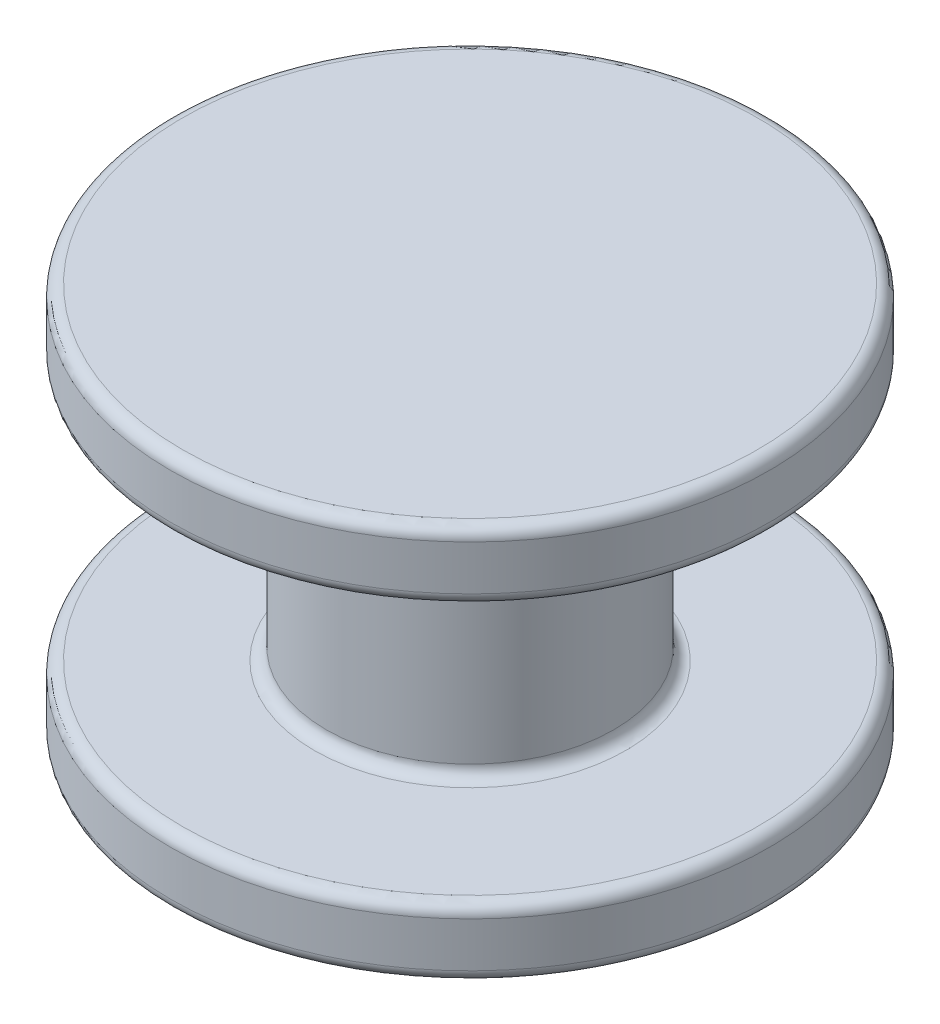
ISO-10303-21;
HEADER;
FILE_DESCRIPTION(('STEP AP214'),'2;1');
FILE_NAME('part.step','',(''),(''),'','','');
FILE_SCHEMA(('AUTOMOTIVE_DESIGN { 1 0 10303 214 1 1 1 1 }'));
ENDSEC;
DATA;
#1=APPLICATION_CONTEXT('core data for automotive mechanical design processes');
#2=APPLICATION_PROTOCOL_DEFINITION('international standard','automotive_design',2000,#1);
#3=PRODUCT_CONTEXT('',#1,'mechanical');
#4=PRODUCT('Part','Part','',(#3));
#5=PRODUCT_RELATED_PRODUCT_CATEGORY('part','',(#4));
#6=PRODUCT_DEFINITION_FORMATION('','',#4);
#7=PRODUCT_DEFINITION_CONTEXT('part definition',#1,'design');
#8=PRODUCT_DEFINITION('design','',#6,#7);
#9=PRODUCT_DEFINITION_SHAPE('','',#8);
#10=(LENGTH_UNIT() NAMED_UNIT(*) SI_UNIT(.MILLI.,.METRE.));
#11=(NAMED_UNIT(*) PLANE_ANGLE_UNIT() SI_UNIT($,.RADIAN.));
#12=(NAMED_UNIT(*) SI_UNIT($,.STERADIAN.) SOLID_ANGLE_UNIT());
#13=UNCERTAINTY_MEASURE_WITH_UNIT(LENGTH_MEASURE(1.E-05),#10,'distance_accuracy_value','');
#14=(GEOMETRIC_REPRESENTATION_CONTEXT(3) GLOBAL_UNCERTAINTY_ASSIGNED_CONTEXT((#13)) GLOBAL_UNIT_ASSIGNED_CONTEXT((#10,
#11,#12)) REPRESENTATION_CONTEXT('',''));
#15=CARTESIAN_POINT('',(0.,0.,0.));
#16=DIRECTION('',(0.,0.,1.));
#17=DIRECTION('',(1.,0.,0.));
#18=AXIS2_PLACEMENT_3D('',#15,#16,#17);
#19=CARTESIAN_POINT('',(0.,1.15,0.));
#20=DIRECTION('',(0.,-1.,0.));
#21=DIRECTION('',(0.,0.,-1.));
#22=AXIS2_PLACEMENT_3D('',#19,#20,#21);
#23=CYLINDRICAL_SURFACE('',#22,5.);
#24=CARTESIAN_POINT('',(0.,0.2,0.));
#25=DIRECTION('',(0.,1.,0.));
#26=DIRECTION('',(0.,0.,1.));
#27=AXIS2_PLACEMENT_3D('',#24,#25,#26);
#28=CIRCLE('',#27,5.);
#29=CARTESIAN_POINT('',(0.,0.2,5.));
#30=VERTEX_POINT('',#29);
#31=EDGE_CURVE('E88',#30,#30,#28,.T.);
#32=ORIENTED_EDGE('',*,*,#31,.T.);
#33=EDGE_LOOP('',(#32));
#34=FACE_BOUND('',#33,.T.);
#35=CARTESIAN_POINT('',(0.,0.95,0.));
#36=DIRECTION('',(0.,1.,0.));
#37=DIRECTION('',(0.,0.,1.));
#38=AXIS2_PLACEMENT_3D('',#35,#36,#37);
#39=CIRCLE('',#38,5.);
#40=CARTESIAN_POINT('',(0.,0.95,5.));
#41=VERTEX_POINT('',#40);
#42=EDGE_CURVE('E92',#41,#41,#39,.F.);
#43=ORIENTED_EDGE('',*,*,#42,.T.);
#44=EDGE_LOOP('',(#43));
#45=FACE_BOUND('',#44,.T.);
#46=ADVANCED_FACE('F40',(#34,#45),#23,.T.);
#47=CARTESIAN_POINT('',(0.,1.15,0.));
#48=DIRECTION('',(0.,1.,0.));
#49=DIRECTION('',(0.,0.,1.));
#50=AXIS2_PLACEMENT_3D('',#47,#48,#49);
#51=PLANE('',#50);
#52=CARTESIAN_POINT('',(0.,1.15,0.));
#53=DIRECTION('',(0.,1.,0.));
#54=DIRECTION('',(0.,0.,1.));
#55=AXIS2_PLACEMENT_3D('',#52,#53,#54);
#56=CIRCLE('',#55,2.6);
#57=CARTESIAN_POINT('',(0.,1.15,2.6));
#58=VERTEX_POINT('',#57);
#59=EDGE_CURVE('E58',#58,#58,#56,.F.);
#60=ORIENTED_EDGE('',*,*,#59,.T.);
#61=EDGE_LOOP('',(#60));
#62=FACE_BOUND('',#61,.T.);
#63=CARTESIAN_POINT('',(0.,1.15,0.));
#64=DIRECTION('',(0.,1.,0.));
#65=DIRECTION('',(0.,0.,1.));
#66=AXIS2_PLACEMENT_3D('',#63,#64,#65);
#67=CIRCLE('',#66,4.8);
#68=CARTESIAN_POINT('',(0.,1.15,4.8));
#69=VERTEX_POINT('',#68);
#70=EDGE_CURVE('E64',#69,#69,#67,.T.);
#71=ORIENTED_EDGE('',*,*,#70,.T.);
#72=EDGE_LOOP('',(#71));
#73=FACE_BOUND('',#72,.T.);
#74=ADVANCED_FACE('F106',(#62,#73),#51,.T.);
#75=CARTESIAN_POINT('',(0.,0.,0.));
#76=DIRECTION('',(0.,1.,0.));
#77=DIRECTION('',(0.,0.,1.));
#78=AXIS2_PLACEMENT_3D('',#75,#76,#77);
#79=PLANE('',#78);
#80=CARTESIAN_POINT('',(0.,0.,0.));
#81=DIRECTION('',(0.,1.,0.));
#82=DIRECTION('',(0.,0.,1.));
#83=AXIS2_PLACEMENT_3D('',#80,#81,#82);
#84=CIRCLE('',#83,4.8);
#85=CARTESIAN_POINT('',(0.,0.,4.8));
#86=VERTEX_POINT('',#85);
#87=EDGE_CURVE('E84',#86,#86,#84,.F.);
#88=ORIENTED_EDGE('',*,*,#87,.T.);
#89=EDGE_LOOP('',(#88));
#90=FACE_BOUND('',#89,.T.);
#91=ADVANCED_FACE('F108',(#90),#79,.F.);
#92=CARTESIAN_POINT('',(0.,5.45,0.));
#93=DIRECTION('',(0.,-1.,0.));
#94=DIRECTION('',(0.,0.,-1.));
#95=AXIS2_PLACEMENT_3D('',#92,#93,#94);
#96=CYLINDRICAL_SURFACE('',#95,2.4);
#97=CARTESIAN_POINT('',(0.,5.25,0.));
#98=DIRECTION('',(0.,1.,0.));
#99=DIRECTION('',(0.,0.,1.));
#100=AXIS2_PLACEMENT_3D('',#97,#98,#99);
#101=CIRCLE('',#100,2.4);
#102=CARTESIAN_POINT('',(0.,5.25,2.4));
#103=VERTEX_POINT('',#102);
#104=EDGE_CURVE('E68',#103,#103,#101,.F.);
#105=ORIENTED_EDGE('',*,*,#104,.T.);
#106=EDGE_LOOP('',(#105));
#107=FACE_BOUND('',#106,.T.);
#108=CARTESIAN_POINT('',(0.,1.35,0.));
#109=DIRECTION('',(0.,1.,0.));
#110=DIRECTION('',(0.,0.,1.));
#111=AXIS2_PLACEMENT_3D('',#108,#109,#110);
#112=CIRCLE('',#111,2.4);
#113=CARTESIAN_POINT('',(0.,1.35,2.4));
#114=VERTEX_POINT('',#113);
#115=EDGE_CURVE('E72',#114,#114,#112,.T.);
#116=ORIENTED_EDGE('',*,*,#115,.T.);
#117=EDGE_LOOP('',(#116));
#118=FACE_BOUND('',#117,.T.);
#119=ADVANCED_FACE('F115',(#107,#118),#96,.T.);
#120=CARTESIAN_POINT('',(0.,6.6,0.));
#121=DIRECTION('',(0.,-1.,0.));
#122=DIRECTION('',(0.,0.,-1.));
#123=AXIS2_PLACEMENT_3D('',#120,#121,#122);
#124=CYLINDRICAL_SURFACE('',#123,5.);
#125=CARTESIAN_POINT('',(0.,5.65,0.));
#126=DIRECTION('',(0.,1.,0.));
#127=DIRECTION('',(0.,0.,1.));
#128=AXIS2_PLACEMENT_3D('',#125,#126,#127);
#129=CIRCLE('',#128,5.);
#130=CARTESIAN_POINT('',(0.,5.65,5.));
#131=VERTEX_POINT('',#130);
#132=EDGE_CURVE('E48',#131,#131,#129,.T.);
#133=ORIENTED_EDGE('',*,*,#132,.T.);
#134=EDGE_LOOP('',(#133));
#135=FACE_BOUND('',#134,.T.);
#136=CARTESIAN_POINT('',(0.,6.4,0.));
#137=DIRECTION('',(0.,1.,0.));
#138=DIRECTION('',(0.,0.,1.));
#139=AXIS2_PLACEMENT_3D('',#136,#137,#138);
#140=CIRCLE('',#139,5.);
#141=CARTESIAN_POINT('',(0.,6.4,5.));
#142=VERTEX_POINT('',#141);
#143=EDGE_CURVE('E53',#142,#142,#140,.F.);
#144=ORIENTED_EDGE('',*,*,#143,.T.);
#145=EDGE_LOOP('',(#144));
#146=FACE_BOUND('',#145,.T.);
#147=ADVANCED_FACE('F150',(#135,#146),#124,.T.);
#148=CARTESIAN_POINT('',(0.,6.6,0.));
#149=DIRECTION('',(0.,1.,0.));
#150=DIRECTION('',(0.,0.,1.));
#151=AXIS2_PLACEMENT_3D('',#148,#149,#150);
#152=PLANE('',#151);
#153=CARTESIAN_POINT('',(0.,6.6,0.));
#154=DIRECTION('',(0.,1.,0.));
#155=DIRECTION('',(0.,0.,1.));
#156=AXIS2_PLACEMENT_3D('',#153,#154,#155);
#157=CIRCLE('',#156,4.8);
#158=CARTESIAN_POINT('',(0.,6.6,4.8));
#159=VERTEX_POINT('',#158);
#160=EDGE_CURVE('E10',#159,#159,#157,.T.);
#161=ORIENTED_EDGE('',*,*,#160,.T.);
#162=EDGE_LOOP('',(#161));
#163=FACE_BOUND('',#162,.T.);
#164=ADVANCED_FACE('F144',(#163),#152,.T.);
#165=CARTESIAN_POINT('',(0.,5.45,0.));
#166=DIRECTION('',(0.,1.,0.));
#167=DIRECTION('',(0.,0.,1.));
#168=AXIS2_PLACEMENT_3D('',#165,#166,#167);
#169=PLANE('',#168);
#170=CARTESIAN_POINT('',(0.,5.45,0.));
#171=DIRECTION('',(0.,1.,0.));
#172=DIRECTION('',(0.,0.,1.));
#173=AXIS2_PLACEMENT_3D('',#170,#171,#172);
#174=CIRCLE('',#173,2.6);
#175=CARTESIAN_POINT('',(0.,5.45,2.6));
#176=VERTEX_POINT('',#175);
#177=EDGE_CURVE('E76',#176,#176,#174,.T.);
#178=ORIENTED_EDGE('',*,*,#177,.T.);
#179=EDGE_LOOP('',(#178));
#180=FACE_BOUND('',#179,.T.);
#181=CARTESIAN_POINT('',(0.,5.45,0.));
#182=DIRECTION('',(0.,1.,0.));
#183=DIRECTION('',(0.,0.,1.));
#184=AXIS2_PLACEMENT_3D('',#181,#182,#183);
#185=CIRCLE('',#184,4.8);
#186=CARTESIAN_POINT('',(0.,5.45,4.8));
#187=VERTEX_POINT('',#186);
#188=EDGE_CURVE('E80',#187,#187,#185,.F.);
#189=ORIENTED_EDGE('',*,*,#188,.T.);
#190=EDGE_LOOP('',(#189));
#191=FACE_BOUND('',#190,.T.);
#192=ADVANCED_FACE('F127',(#180,#191),#169,.F.);
#193=CARTESIAN_POINT('',(0.,0.2,0.));
#194=DIRECTION('',(0.,1.,0.));
#195=DIRECTION('',(0.,0.,1.));
#196=AXIS2_PLACEMENT_3D('',#193,#194,#195);
#197=TOROIDAL_SURFACE('',#196,4.8,0.2);
#198=ORIENTED_EDGE('',*,*,#87,.F.);
#199=EDGE_LOOP('',(#198));
#200=FACE_BOUND('',#199,.T.);
#201=ORIENTED_EDGE('',*,*,#31,.F.);
#202=EDGE_LOOP('',(#201));
#203=FACE_BOUND('',#202,.T.);
#204=ADVANCED_FACE('F123',(#200,#203),#197,.T.);
#205=CARTESIAN_POINT('',(0.,5.25,0.));
#206=DIRECTION('',(0.,1.,0.));
#207=DIRECTION('',(0.,0.,1.));
#208=AXIS2_PLACEMENT_3D('',#205,#206,#207);
#209=TOROIDAL_SURFACE('',#208,2.6,0.2);
#210=ORIENTED_EDGE('',*,*,#104,.F.);
#211=EDGE_LOOP('',(#210));
#212=FACE_BOUND('',#211,.T.);
#213=ORIENTED_EDGE('',*,*,#177,.F.);
#214=EDGE_LOOP('',(#213));
#215=FACE_BOUND('',#214,.T.);
#216=ADVANCED_FACE('F126',(#212,#215),#209,.F.);
#217=CARTESIAN_POINT('',(0.,1.35,0.));
#218=DIRECTION('',(0.,1.,0.));
#219=DIRECTION('',(0.,0.,1.));
#220=AXIS2_PLACEMENT_3D('',#217,#218,#219);
#221=TOROIDAL_SURFACE('',#220,2.6,0.2);
#222=ORIENTED_EDGE('',*,*,#59,.F.);
#223=EDGE_LOOP('',(#222));
#224=FACE_BOUND('',#223,.T.);
#225=ORIENTED_EDGE('',*,*,#115,.F.);
#226=EDGE_LOOP('',(#225));
#227=FACE_BOUND('',#226,.T.);
#228=ADVANCED_FACE('F102',(#224,#227),#221,.F.);
#229=CARTESIAN_POINT('',(0.,0.95,0.));
#230=DIRECTION('',(0.,1.,0.));
#231=DIRECTION('',(0.,0.,1.));
#232=AXIS2_PLACEMENT_3D('',#229,#230,#231);
#233=TOROIDAL_SURFACE('',#232,4.8,0.2);
#234=ORIENTED_EDGE('',*,*,#42,.F.);
#235=EDGE_LOOP('',(#234));
#236=FACE_BOUND('',#235,.T.);
#237=ORIENTED_EDGE('',*,*,#70,.F.);
#238=EDGE_LOOP('',(#237));
#239=FACE_BOUND('',#238,.T.);
#240=ADVANCED_FACE('F98',(#236,#239),#233,.T.);
#241=CARTESIAN_POINT('',(0.,5.65,0.));
#242=DIRECTION('',(0.,1.,0.));
#243=DIRECTION('',(0.,0.,1.));
#244=AXIS2_PLACEMENT_3D('',#241,#242,#243);
#245=TOROIDAL_SURFACE('',#244,4.8,0.2);
#246=ORIENTED_EDGE('',*,*,#188,.F.);
#247=EDGE_LOOP('',(#246));
#248=FACE_BOUND('',#247,.T.);
#249=ORIENTED_EDGE('',*,*,#132,.F.);
#250=EDGE_LOOP('',(#249));
#251=FACE_BOUND('',#250,.T.);
#252=ADVANCED_FACE('F101',(#248,#251),#245,.T.);
#253=CARTESIAN_POINT('',(0.,6.4,0.));
#254=DIRECTION('',(0.,1.,0.));
#255=DIRECTION('',(0.,0.,1.));
#256=AXIS2_PLACEMENT_3D('',#253,#254,#255);
#257=TOROIDAL_SURFACE('',#256,4.8,0.2);
#258=ORIENTED_EDGE('',*,*,#143,.F.);
#259=EDGE_LOOP('',(#258));
#260=FACE_BOUND('',#259,.T.);
#261=ORIENTED_EDGE('',*,*,#160,.F.);
#262=EDGE_LOOP('',(#261));
#263=FACE_BOUND('',#262,.T.);
#264=ADVANCED_FACE('F42',(#260,#263),#257,.T.);
#265=CLOSED_SHELL('',(#46,#74,#91,#119,#147,#164,#192,#204,#216,#228,#240,#252,#264));
#266=MANIFOLD_SOLID_BREP('B2',#265);
#267=ADVANCED_BREP_SHAPE_REPRESENTATION('',(#18,#266),#14);
#268=SHAPE_DEFINITION_REPRESENTATION(#9,#267);
ENDSEC;
END-ISO-10303-21;
